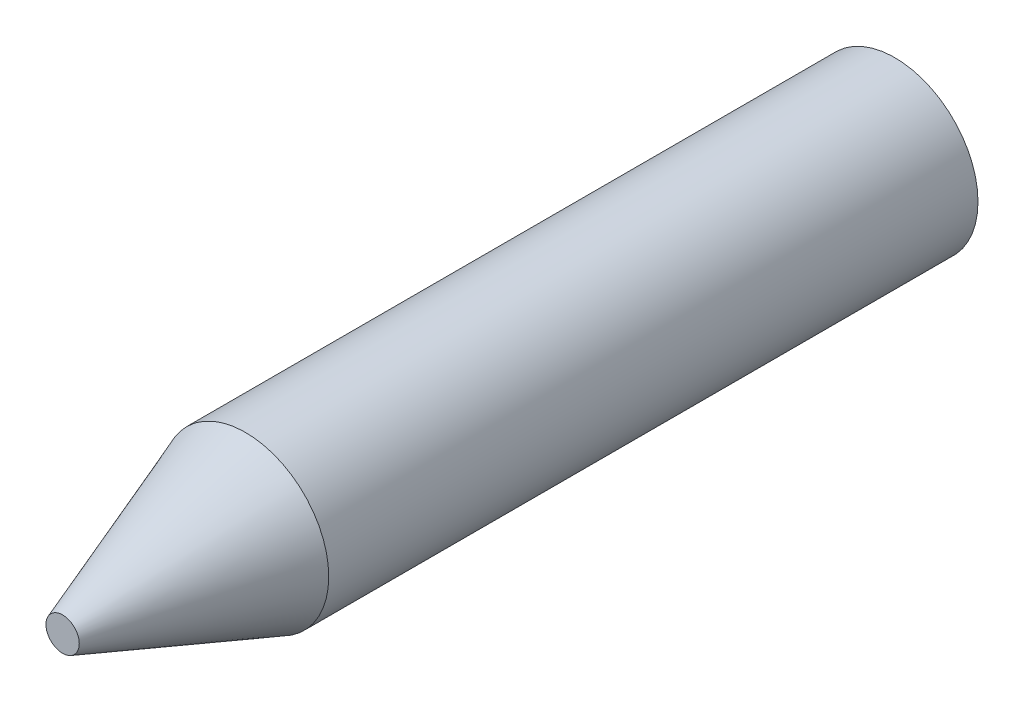
ISO-10303-21;
HEADER;
FILE_DESCRIPTION(('STEP AP214'),'2;1');
FILE_NAME('part.step','',(''),(''),'','','');
FILE_SCHEMA(('AUTOMOTIVE_DESIGN { 1 0 10303 214 1 1 1 1 }'));
ENDSEC;
DATA;
#1=APPLICATION_CONTEXT('core data for automotive mechanical design processes');
#2=APPLICATION_PROTOCOL_DEFINITION('international standard','automotive_design',2000,#1);
#3=PRODUCT_CONTEXT('',#1,'mechanical');
#4=PRODUCT('Part','Part','',(#3));
#5=PRODUCT_RELATED_PRODUCT_CATEGORY('part','',(#4));
#6=PRODUCT_DEFINITION_FORMATION('','',#4);
#7=PRODUCT_DEFINITION_CONTEXT('part definition',#1,'design');
#8=PRODUCT_DEFINITION('design','',#6,#7);
#9=PRODUCT_DEFINITION_SHAPE('','',#8);
#10=(LENGTH_UNIT() NAMED_UNIT(*) SI_UNIT(.MILLI.,.METRE.));
#11=(NAMED_UNIT(*) PLANE_ANGLE_UNIT() SI_UNIT($,.RADIAN.));
#12=(NAMED_UNIT(*) SI_UNIT($,.STERADIAN.) SOLID_ANGLE_UNIT());
#13=UNCERTAINTY_MEASURE_WITH_UNIT(LENGTH_MEASURE(1.E-05),#10,'distance_accuracy_value','');
#14=(GEOMETRIC_REPRESENTATION_CONTEXT(3) GLOBAL_UNCERTAINTY_ASSIGNED_CONTEXT((#13)) GLOBAL_UNIT_ASSIGNED_CONTEXT((#10,
#11,#12)) REPRESENTATION_CONTEXT('',''));
#15=CARTESIAN_POINT('',(0.,0.,0.));
#16=DIRECTION('',(0.,0.,1.));
#17=DIRECTION('',(1.,0.,0.));
#18=AXIS2_PLACEMENT_3D('',#15,#16,#17);
#19=CARTESIAN_POINT('',(0.,0.,-100.));
#20=DIRECTION('',(0.,0.,-1.));
#21=DIRECTION('',(-1.,0.,0.));
#22=AXIS2_PLACEMENT_3D('',#19,#20,#21);
#23=PLANE('',#22);
#24=CARTESIAN_POINT('',(0.,0.,-100.));
#25=DIRECTION('',(0.,0.,1.));
#26=DIRECTION('',(1.,0.,0.));
#27=AXIS2_PLACEMENT_3D('',#24,#25,#26);
#28=CIRCLE('',#27,10.);
#29=CARTESIAN_POINT('',(10.,0.,-100.));
#30=VERTEX_POINT('',#29);
#31=EDGE_CURVE('E10',#30,#30,#28,.T.);
#32=ORIENTED_EDGE('',*,*,#31,.F.);
#33=EDGE_LOOP('',(#32));
#34=FACE_BOUND('',#33,.T.);
#35=ADVANCED_FACE('F30',(#34),#23,.T.);
#36=CARTESIAN_POINT('',(0.,0.,68.6931684040079));
#37=DIRECTION('',(0.,0.,1.));
#38=DIRECTION('',(1.,0.,0.));
#39=AXIS2_PLACEMENT_3D('',#36,#37,#38);
#40=CYLINDRICAL_SURFACE('',#39,10.);
#41=ORIENTED_EDGE('',*,*,#31,.T.);
#42=EDGE_LOOP('',(#41));
#43=FACE_BOUND('',#42,.T.);
#44=CARTESIAN_POINT('',(0.,0.,-21.9798193556369));
#45=DIRECTION('',(0.,0.,1.));
#46=DIRECTION('',(1.,0.,0.));
#47=AXIS2_PLACEMENT_3D('',#44,#45,#46);
#48=CIRCLE('',#47,10.);
#49=CARTESIAN_POINT('',(10.,0.,-21.9798193556369));
#50=VERTEX_POINT('',#49);
#51=EDGE_CURVE('E36',#50,#50,#48,.T.);
#52=ORIENTED_EDGE('',*,*,#51,.F.);
#53=EDGE_LOOP('',(#52));
#54=FACE_BOUND('',#53,.T.);
#55=ADVANCED_FACE('F51',(#43,#54),#40,.T.);
#56=CARTESIAN_POINT('',(0.,0.,0.));
#57=DIRECTION('',(0.,0.,-1.));
#58=DIRECTION('',(-1.,0.,0.));
#59=AXIS2_PLACEMENT_3D('',#56,#57,#58);
#60=CONICAL_SURFACE('',#59,2.,0.349065850398867);
#61=ORIENTED_EDGE('',*,*,#51,.T.);
#62=EDGE_LOOP('',(#61));
#63=FACE_BOUND('',#62,.T.);
#64=CARTESIAN_POINT('',(0.,0.,0.));
#65=DIRECTION('',(0.,0.,1.));
#66=DIRECTION('',(1.,0.,0.));
#67=AXIS2_PLACEMENT_3D('',#64,#65,#66);
#68=CIRCLE('',#67,2.);
#69=CARTESIAN_POINT('',(2.,0.,0.));
#70=VERTEX_POINT('',#69);
#71=EDGE_CURVE('E40',#70,#70,#68,.T.);
#72=ORIENTED_EDGE('',*,*,#71,.F.);
#73=EDGE_LOOP('',(#72));
#74=FACE_BOUND('',#73,.T.);
#75=ADVANCED_FACE('F49',(#63,#74),#60,.T.);
#76=CARTESIAN_POINT('',(2.,0.,0.));
#77=DIRECTION('',(0.,0.,1.));
#78=DIRECTION('',(1.,0.,0.));
#79=AXIS2_PLACEMENT_3D('',#76,#77,#78);
#80=PLANE('',#79);
#81=ORIENTED_EDGE('',*,*,#71,.T.);
#82=EDGE_LOOP('',(#81));
#83=FACE_BOUND('',#82,.T.);
#84=ADVANCED_FACE('F47',(#83),#80,.T.);
#85=CLOSED_SHELL('',(#35,#55,#75,#84));
#86=MANIFOLD_SOLID_BREP('B2',#85);
#87=ADVANCED_BREP_SHAPE_REPRESENTATION('',(#18,#86),#14);
#88=SHAPE_DEFINITION_REPRESENTATION(#9,#87);
ENDSEC;
END-ISO-10303-21;
